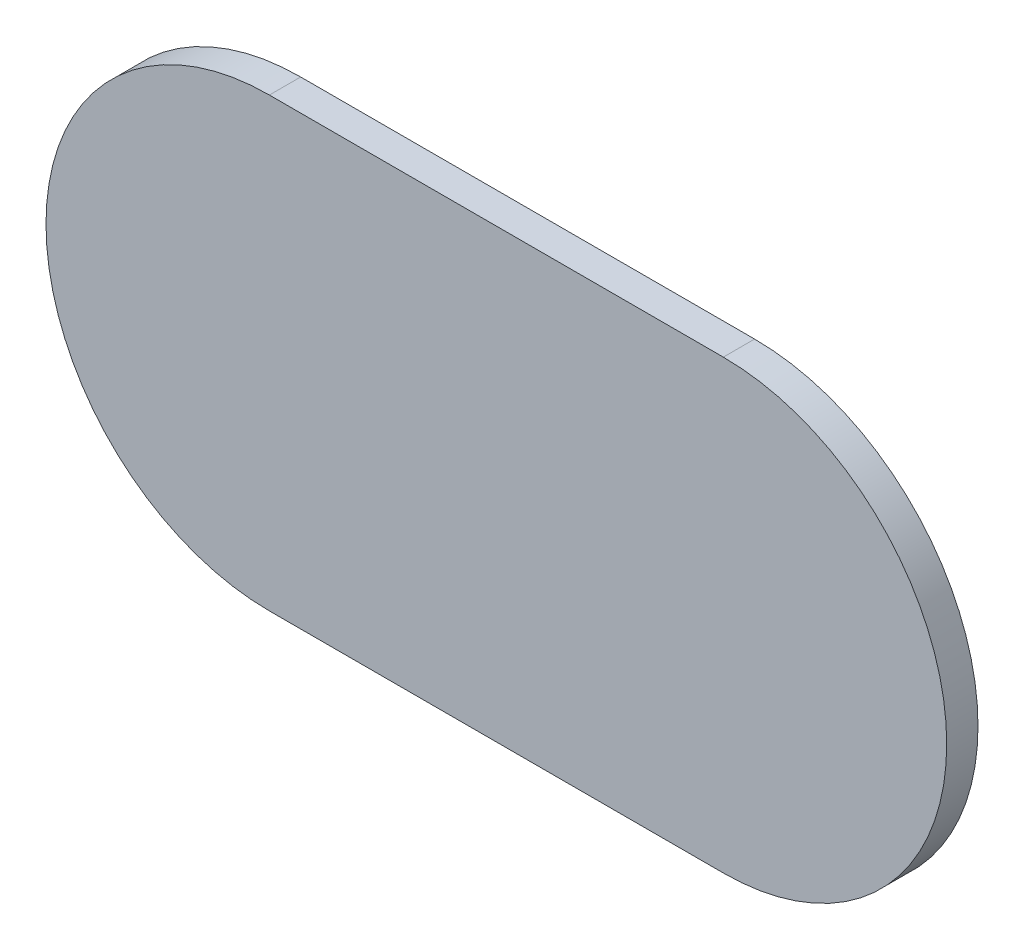
ISO-10303-21;
HEADER;
FILE_DESCRIPTION(('STEP AP214'),'2;1');
FILE_NAME('part.step','',(''),(''),'','','');
FILE_SCHEMA(('AUTOMOTIVE_DESIGN { 1 0 10303 214 1 1 1 1 }'));
ENDSEC;
DATA;
#1=APPLICATION_CONTEXT('core data for automotive mechanical design processes');
#2=APPLICATION_PROTOCOL_DEFINITION('international standard','automotive_design',2000,#1);
#3=PRODUCT_CONTEXT('',#1,'mechanical');
#4=PRODUCT('Part','Part','',(#3));
#5=PRODUCT_RELATED_PRODUCT_CATEGORY('part','',(#4));
#6=PRODUCT_DEFINITION_FORMATION('','',#4);
#7=PRODUCT_DEFINITION_CONTEXT('part definition',#1,'design');
#8=PRODUCT_DEFINITION('design','',#6,#7);
#9=PRODUCT_DEFINITION_SHAPE('','',#8);
#10=(LENGTH_UNIT() NAMED_UNIT(*) SI_UNIT(.MILLI.,.METRE.));
#11=(NAMED_UNIT(*) PLANE_ANGLE_UNIT() SI_UNIT($,.RADIAN.));
#12=(NAMED_UNIT(*) SI_UNIT($,.STERADIAN.) SOLID_ANGLE_UNIT());
#13=UNCERTAINTY_MEASURE_WITH_UNIT(LENGTH_MEASURE(1.E-05),#10,'distance_accuracy_value','');
#14=(GEOMETRIC_REPRESENTATION_CONTEXT(3) GLOBAL_UNCERTAINTY_ASSIGNED_CONTEXT((#13)) GLOBAL_UNIT_ASSIGNED_CONTEXT((#10,
#11,#12)) REPRESENTATION_CONTEXT('',''));
#15=CARTESIAN_POINT('',(0.,0.,0.));
#16=DIRECTION('',(0.,0.,1.));
#17=DIRECTION('',(1.,0.,0.));
#18=AXIS2_PLACEMENT_3D('',#15,#16,#17);
#19=CARTESIAN_POINT('',(167.894,-145.284,0.));
#20=DIRECTION('',(0.,0.,1.));
#21=DIRECTION('',(1.,0.,0.));
#22=AXIS2_PLACEMENT_3D('',#19,#20,#21);
#23=PLANE('',#22);
#24=DIRECTION('',(1.,0.,0.));
#25=VECTOR('',#24,1.);
#26=CARTESIAN_POINT('',(167.894,-145.284,0.));
#27=LINE('',#26,#25);
#28=CARTESIAN_POINT('',(167.894,-145.284,0.));
#29=VERTEX_POINT('',#28);
#30=CARTESIAN_POINT('',(168.402,-145.284,0.));
#31=VERTEX_POINT('',#30);
#32=EDGE_CURVE('E82',#29,#31,#27,.T.);
#33=ORIENTED_EDGE('',*,*,#32,.T.);
#34=CARTESIAN_POINT('',(168.402,-145.034,0.));
#35=DIRECTION('',(0.,0.,1.));
#36=DIRECTION('',(0.,-1.,0.));
#37=AXIS2_PLACEMENT_3D('',#34,#35,#36);
#38=CIRCLE('',#37,0.25);
#39=CARTESIAN_POINT('',(168.402,-144.784,0.));
#40=VERTEX_POINT('',#39);
#41=EDGE_CURVE('E101',#31,#40,#38,.T.);
#42=ORIENTED_EDGE('',*,*,#41,.T.);
#43=DIRECTION('',(-1.,0.,0.));
#44=VECTOR('',#43,1.);
#45=CARTESIAN_POINT('',(168.402,-144.784,0.));
#46=LINE('',#45,#44);
#47=CARTESIAN_POINT('',(167.894,-144.784,0.));
#48=VERTEX_POINT('',#47);
#49=EDGE_CURVE('E74',#40,#48,#46,.T.);
#50=ORIENTED_EDGE('',*,*,#49,.T.);
#51=CARTESIAN_POINT('',(167.894,-145.034,0.));
#52=DIRECTION('',(0.,0.,1.));
#53=DIRECTION('',(0.,1.,0.));
#54=AXIS2_PLACEMENT_3D('',#51,#52,#53);
#55=CIRCLE('',#54,0.25);
#56=EDGE_CURVE('E11',#48,#29,#55,.T.);
#57=ORIENTED_EDGE('',*,*,#56,.T.);
#58=EDGE_LOOP('',(#33,#42,#50,#57));
#59=FACE_BOUND('',#58,.T.);
#60=ADVANCED_FACE('F17',(#59),#23,.T.);
#61=CARTESIAN_POINT('',(167.894,-145.284,-0.035));
#62=DIRECTION('',(0.,0.,1.));
#63=DIRECTION('',(1.,0.,0.));
#64=AXIS2_PLACEMENT_3D('',#61,#62,#63);
#65=PLANE('',#64);
#66=CARTESIAN_POINT('',(167.894,-145.034,-0.035));
#67=DIRECTION('',(0.,0.,1.));
#68=DIRECTION('',(0.,1.,0.));
#69=AXIS2_PLACEMENT_3D('',#66,#67,#68);
#70=CIRCLE('',#69,0.25);
#71=CARTESIAN_POINT('',(167.894,-144.784,-0.035));
#72=VERTEX_POINT('',#71);
#73=CARTESIAN_POINT('',(167.894,-145.284,-0.035));
#74=VERTEX_POINT('',#73);
#75=EDGE_CURVE('E25',#72,#74,#70,.T.);
#76=ORIENTED_EDGE('',*,*,#75,.F.);
#77=DIRECTION('',(-1.,0.,0.));
#78=VECTOR('',#77,1.);
#79=CARTESIAN_POINT('',(168.402,-144.784,-0.035));
#80=LINE('',#79,#78);
#81=CARTESIAN_POINT('',(168.402,-144.784,-0.035));
#82=VERTEX_POINT('',#81);
#83=EDGE_CURVE('E98',#82,#72,#80,.T.);
#84=ORIENTED_EDGE('',*,*,#83,.F.);
#85=CARTESIAN_POINT('',(168.402,-145.034,-0.035));
#86=DIRECTION('',(0.,0.,1.));
#87=DIRECTION('',(0.,-1.,0.));
#88=AXIS2_PLACEMENT_3D('',#85,#86,#87);
#89=CIRCLE('',#88,0.25);
#90=CARTESIAN_POINT('',(168.402,-145.284,-0.035));
#91=VERTEX_POINT('',#90);
#92=EDGE_CURVE('E84',#91,#82,#89,.T.);
#93=ORIENTED_EDGE('',*,*,#92,.F.);
#94=DIRECTION('',(1.,0.,0.));
#95=VECTOR('',#94,1.);
#96=CARTESIAN_POINT('',(167.894,-145.284,-0.035));
#97=LINE('',#96,#95);
#98=EDGE_CURVE('E80',#74,#91,#97,.T.);
#99=ORIENTED_EDGE('',*,*,#98,.F.);
#100=EDGE_LOOP('',(#76,#84,#93,#99));
#101=FACE_BOUND('',#100,.T.);
#102=ADVANCED_FACE('F86',(#101),#65,.F.);
#103=CARTESIAN_POINT('',(167.894,-145.034,-0.035));
#104=DIRECTION('',(0.,0.,-1.));
#105=DIRECTION('',(0.,1.,0.));
#106=AXIS2_PLACEMENT_3D('',#103,#104,#105);
#107=CYLINDRICAL_SURFACE('',#106,0.25);
#108=ORIENTED_EDGE('',*,*,#75,.T.);
#109=DIRECTION('',(0.,0.,1.));
#110=VECTOR('',#109,1.);
#111=CARTESIAN_POINT('',(167.894,-145.284,-0.035));
#112=LINE('',#111,#110);
#113=EDGE_CURVE('E68',#74,#29,#112,.T.);
#114=ORIENTED_EDGE('',*,*,#113,.T.);
#115=ORIENTED_EDGE('',*,*,#56,.F.);
#116=DIRECTION('',(0.,0.,1.));
#117=VECTOR('',#116,1.);
#118=CARTESIAN_POINT('',(167.894,-144.784,-0.035));
#119=LINE('',#118,#117);
#120=EDGE_CURVE('E71',#72,#48,#119,.T.);
#121=ORIENTED_EDGE('',*,*,#120,.F.);
#122=EDGE_LOOP('',(#108,#114,#115,#121));
#123=FACE_BOUND('',#122,.T.);
#124=ADVANCED_FACE('F67',(#123),#107,.T.);
#125=CARTESIAN_POINT('',(168.402,-144.784,-0.035));
#126=DIRECTION('',(0.,-1.,0.));
#127=DIRECTION('',(0.,0.,-1.));
#128=AXIS2_PLACEMENT_3D('',#125,#126,#127);
#129=PLANE('',#128);
#130=ORIENTED_EDGE('',*,*,#83,.T.);
#131=ORIENTED_EDGE('',*,*,#120,.T.);
#132=ORIENTED_EDGE('',*,*,#49,.F.);
#133=DIRECTION('',(0.,0.,1.));
#134=VECTOR('',#133,1.);
#135=CARTESIAN_POINT('',(168.402,-144.784,-0.035));
#136=LINE('',#135,#134);
#137=EDGE_CURVE('E106',#82,#40,#136,.T.);
#138=ORIENTED_EDGE('',*,*,#137,.F.);
#139=EDGE_LOOP('',(#130,#131,#132,#138));
#140=FACE_BOUND('',#139,.T.);
#141=ADVANCED_FACE('F120',(#140),#129,.F.);
#142=CARTESIAN_POINT('',(168.402,-145.034,-0.035));
#143=DIRECTION('',(0.,0.,-1.));
#144=DIRECTION('',(0.,-1.,0.));
#145=AXIS2_PLACEMENT_3D('',#142,#143,#144);
#146=CYLINDRICAL_SURFACE('',#145,0.25);
#147=ORIENTED_EDGE('',*,*,#92,.T.);
#148=ORIENTED_EDGE('',*,*,#137,.T.);
#149=ORIENTED_EDGE('',*,*,#41,.F.);
#150=DIRECTION('',(0.,0.,1.));
#151=VECTOR('',#150,1.);
#152=CARTESIAN_POINT('',(168.402,-145.284,-0.035));
#153=LINE('',#152,#151);
#154=EDGE_CURVE('E90',#91,#31,#153,.T.);
#155=ORIENTED_EDGE('',*,*,#154,.F.);
#156=EDGE_LOOP('',(#147,#148,#149,#155));
#157=FACE_BOUND('',#156,.T.);
#158=ADVANCED_FACE('F122',(#157),#146,.T.);
#159=CARTESIAN_POINT('',(167.894,-145.284,-0.035));
#160=DIRECTION('',(0.,1.,0.));
#161=DIRECTION('',(1.,0.,0.));
#162=AXIS2_PLACEMENT_3D('',#159,#160,#161);
#163=PLANE('',#162);
#164=ORIENTED_EDGE('',*,*,#98,.T.);
#165=ORIENTED_EDGE('',*,*,#154,.T.);
#166=ORIENTED_EDGE('',*,*,#32,.F.);
#167=ORIENTED_EDGE('',*,*,#113,.F.);
#168=EDGE_LOOP('',(#164,#165,#166,#167));
#169=FACE_BOUND('',#168,.T.);
#170=ADVANCED_FACE('F78',(#169),#163,.F.);
#171=CLOSED_SHELL('',(#60,#102,#124,#141,#158,#170));
#172=MANIFOLD_SOLID_BREP('B1',#171);
#173=ADVANCED_BREP_SHAPE_REPRESENTATION('',(#18,#172),#14);
#174=SHAPE_DEFINITION_REPRESENTATION(#9,#173);
ENDSEC;
END-ISO-10303-21;
